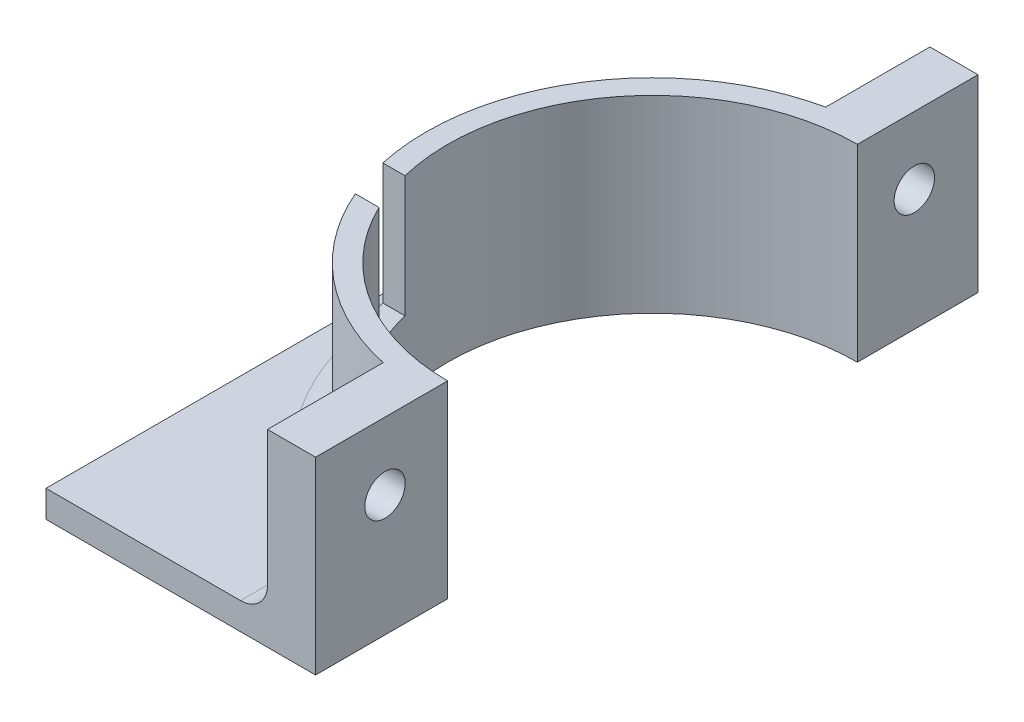
ISO-10303-21;
HEADER;
FILE_DESCRIPTION(('STEP AP214'),'2;1');
FILE_NAME('part.step','',(''),(''),'','','');
FILE_SCHEMA(('AUTOMOTIVE_DESIGN { 1 0 10303 214 1 1 1 1 }'));
ENDSEC;
DATA;
#1=APPLICATION_CONTEXT('core data for automotive mechanical design processes');
#2=APPLICATION_PROTOCOL_DEFINITION('international standard','automotive_design',2000,#1);
#3=PRODUCT_CONTEXT('',#1,'mechanical');
#4=PRODUCT('Part','Part','',(#3));
#5=PRODUCT_RELATED_PRODUCT_CATEGORY('part','',(#4));
#6=PRODUCT_DEFINITION_FORMATION('','',#4);
#7=PRODUCT_DEFINITION_CONTEXT('part definition',#1,'design');
#8=PRODUCT_DEFINITION('design','',#6,#7);
#9=PRODUCT_DEFINITION_SHAPE('','',#8);
#10=(LENGTH_UNIT() NAMED_UNIT(*) SI_UNIT(.MILLI.,.METRE.));
#11=(NAMED_UNIT(*) PLANE_ANGLE_UNIT() SI_UNIT($,.RADIAN.));
#12=(NAMED_UNIT(*) SI_UNIT($,.STERADIAN.) SOLID_ANGLE_UNIT());
#13=UNCERTAINTY_MEASURE_WITH_UNIT(LENGTH_MEASURE(1.E-05),#10,'distance_accuracy_value','');
#14=(GEOMETRIC_REPRESENTATION_CONTEXT(3) GLOBAL_UNCERTAINTY_ASSIGNED_CONTEXT((#13)) GLOBAL_UNIT_ASSIGNED_CONTEXT((#10,
#11,#12)) REPRESENTATION_CONTEXT('',''));
#15=CARTESIAN_POINT('',(0.,0.,0.));
#16=DIRECTION('',(0.,0.,1.));
#17=DIRECTION('',(1.,0.,0.));
#18=AXIS2_PLACEMENT_3D('',#15,#16,#17);
#19=CARTESIAN_POINT('',(25.4,17.78,-31.75));
#20=DIRECTION('',(0.,-1.,0.));
#21=DIRECTION('',(0.,0.,-1.));
#22=AXIS2_PLACEMENT_3D('',#19,#20,#21);
#23=CYLINDRICAL_SURFACE('',#22,21.336);
#24=DIRECTION('',(0.,-1.,0.));
#25=VECTOR('',#24,1.);
#26=CARTESIAN_POINT('',(5.77942477907439,17.78,-23.368));
#27=LINE('',#26,#25);
#28=CARTESIAN_POINT('',(5.77942477907439,6.35,-23.368));
#29=VERTEX_POINT('',#28);
#30=CARTESIAN_POINT('',(5.77942477907439,17.78,-23.368));
#31=VERTEX_POINT('',#30);
#32=EDGE_CURVE('E408',#29,#31,#27,.F.);
#33=ORIENTED_EDGE('',*,*,#32,.F.);
#34=CARTESIAN_POINT('',(25.4,6.35,-31.75));
#35=DIRECTION('',(0.,1.,0.));
#36=DIRECTION('',(0.,0.,1.));
#37=AXIS2_PLACEMENT_3D('',#34,#35,#36);
#38=CIRCLE('',#37,21.336);
#39=CARTESIAN_POINT('',(4.55961343928573,6.35,-27.178));
#40=VERTEX_POINT('',#39);
#41=EDGE_CURVE('E177',#40,#29,#38,.T.);
#42=ORIENTED_EDGE('',*,*,#41,.F.);
#43=DIRECTION('',(0.,-1.,0.));
#44=VECTOR('',#43,1.);
#45=CARTESIAN_POINT('',(4.55961343928573,17.78,-27.178));
#46=LINE('',#45,#44);
#47=CARTESIAN_POINT('',(4.55961343928573,17.78,-27.178));
#48=VERTEX_POINT('',#47);
#49=EDGE_CURVE('E162',#48,#40,#46,.T.);
#50=ORIENTED_EDGE('',*,*,#49,.F.);
#51=CARTESIAN_POINT('',(25.4,17.78,-31.75));
#52=DIRECTION('',(0.,1.,0.));
#53=DIRECTION('',(0.,0.,1.));
#54=AXIS2_PLACEMENT_3D('',#51,#52,#53);
#55=CIRCLE('',#54,21.336);
#56=CARTESIAN_POINT('',(20.8701679444107,17.78,-52.5995927429808));
#57=VERTEX_POINT('',#56);
#58=EDGE_CURVE('E175',#57,#48,#55,.T.);
#59=ORIENTED_EDGE('',*,*,#58,.F.);
#60=DIRECTION('',(0.,-1.,0.));
#61=VECTOR('',#60,1.);
#62=CARTESIAN_POINT('',(20.8701679444107,17.78,-52.5995927429808));
#63=LINE('',#62,#61);
#64=CARTESIAN_POINT('',(20.8701679444107,5.08,-52.5995927429808));
#65=VERTEX_POINT('',#64);
#66=EDGE_CURVE('E248',#57,#65,#63,.T.);
#67=ORIENTED_EDGE('',*,*,#66,.T.);
#68=CARTESIAN_POINT('',(25.4,5.08,-31.75));
#69=DIRECTION('',(0.,1.,0.));
#70=DIRECTION('',(0.,0.,1.));
#71=AXIS2_PLACEMENT_3D('',#68,#69,#70);
#72=CIRCLE('',#71,21.336);
#73=CARTESIAN_POINT('',(20.8701679444107,5.08,-10.9004072570192));
#74=VERTEX_POINT('',#73);
#75=EDGE_CURVE('E292',#65,#74,#72,.T.);
#76=ORIENTED_EDGE('',*,*,#75,.T.);
#77=DIRECTION('',(0.,-1.,0.));
#78=VECTOR('',#77,1.);
#79=CARTESIAN_POINT('',(20.8701679444107,17.78,-10.9004072570192));
#80=LINE('',#79,#78);
#81=CARTESIAN_POINT('',(20.8701679444107,17.78,-10.9004072570192));
#82=VERTEX_POINT('',#81);
#83=EDGE_CURVE('E245',#82,#74,#80,.T.);
#84=ORIENTED_EDGE('',*,*,#83,.F.);
#85=EDGE_CURVE('E188',#31,#82,#55,.T.);
#86=ORIENTED_EDGE('',*,*,#85,.F.);
#87=EDGE_LOOP('',(#33,#42,#50,#59,#67,#76,#84,#86));
#88=FACE_BOUND('',#87,.T.);
#89=ADVANCED_FACE('F45',(#88),#23,.T.);
#90=CARTESIAN_POINT('',(25.4,17.78,-31.75));
#91=DIRECTION('',(0.,-1.,0.));
#92=DIRECTION('',(0.,0.,-1.));
#93=AXIS2_PLACEMENT_3D('',#90,#91,#92);
#94=CYLINDRICAL_SURFACE('',#93,19.304);
#95=CARTESIAN_POINT('',(25.4,6.35,-31.75));
#96=DIRECTION('',(0.,1.,0.));
#97=DIRECTION('',(0.,0.,1.));
#98=AXIS2_PLACEMENT_3D('',#95,#96,#97);
#99=CIRCLE('',#98,19.304);
#100=CARTESIAN_POINT('',(6.64523441895368,6.35,-27.178));
#101=VERTEX_POINT('',#100);
#102=CARTESIAN_POINT('',(8.01073630080906,6.35,-23.368));
#103=VERTEX_POINT('',#102);
#104=EDGE_CURVE('E11',#101,#103,#99,.T.);
#105=ORIENTED_EDGE('',*,*,#104,.T.);
#106=DIRECTION('',(0.,-1.,0.));
#107=VECTOR('',#106,1.);
#108=CARTESIAN_POINT('',(8.01073630080906,17.78,-23.368));
#109=LINE('',#108,#107);
#110=CARTESIAN_POINT('',(8.01073630080906,17.78,-23.368));
#111=VERTEX_POINT('',#110);
#112=EDGE_CURVE('E179',#103,#111,#109,.F.);
#113=ORIENTED_EDGE('',*,*,#112,.T.);
#114=CARTESIAN_POINT('',(25.4,17.78,-31.75));
#115=DIRECTION('',(0.,1.,0.));
#116=DIRECTION('',(0.,0.,1.));
#117=AXIS2_PLACEMENT_3D('',#114,#115,#116);
#118=CIRCLE('',#117,19.304);
#119=CARTESIAN_POINT('',(25.4,17.78,-12.446));
#120=VERTEX_POINT('',#119);
#121=EDGE_CURVE('E205',#111,#120,#118,.T.);
#122=ORIENTED_EDGE('',*,*,#121,.T.);
#123=DIRECTION('',(0.,-1.,0.));
#124=VECTOR('',#123,1.);
#125=CARTESIAN_POINT('',(25.4,17.78,-12.446));
#126=LINE('',#125,#124);
#127=CARTESIAN_POINT('',(25.4,0.,-12.446));
#128=VERTEX_POINT('',#127);
#129=EDGE_CURVE('E235',#120,#128,#126,.T.);
#130=ORIENTED_EDGE('',*,*,#129,.T.);
#131=CARTESIAN_POINT('',(25.4,0.,-31.75));
#132=DIRECTION('',(0.,1.,0.));
#133=DIRECTION('',(0.,0.,1.));
#134=AXIS2_PLACEMENT_3D('',#131,#132,#133);
#135=CIRCLE('',#134,19.304);
#136=CARTESIAN_POINT('',(25.4,0.,-51.054));
#137=VERTEX_POINT('',#136);
#138=EDGE_CURVE('E219',#137,#128,#135,.T.);
#139=ORIENTED_EDGE('',*,*,#138,.F.);
#140=DIRECTION('',(0.,-1.,0.));
#141=VECTOR('',#140,1.);
#142=CARTESIAN_POINT('',(25.4,17.78,-51.054));
#143=LINE('',#142,#141);
#144=CARTESIAN_POINT('',(25.4,17.78,-51.054));
#145=VERTEX_POINT('',#144);
#146=EDGE_CURVE('E232',#145,#137,#143,.T.);
#147=ORIENTED_EDGE('',*,*,#146,.F.);
#148=CARTESIAN_POINT('',(6.64523441895368,17.78,-27.178));
#149=VERTEX_POINT('',#148);
#150=EDGE_CURVE('E207',#145,#149,#118,.T.);
#151=ORIENTED_EDGE('',*,*,#150,.T.);
#152=DIRECTION('',(0.,-1.,0.));
#153=VECTOR('',#152,1.);
#154=CARTESIAN_POINT('',(6.64523441895368,17.78,-27.178));
#155=LINE('',#154,#153);
#156=EDGE_CURVE('E62',#149,#101,#155,.T.);
#157=ORIENTED_EDGE('',*,*,#156,.T.);
#158=EDGE_LOOP('',(#105,#113,#122,#130,#139,#147,#151,#157));
#159=FACE_BOUND('',#158,.T.);
#160=ADVANCED_FACE('F333',(#159),#94,.F.);
#161=CARTESIAN_POINT('',(0.,17.78,0.));
#162=DIRECTION('',(0.,1.,0.));
#163=DIRECTION('',(0.,0.,1.));
#164=AXIS2_PLACEMENT_3D('',#161,#162,#163);
#165=PLANE('',#164);
#166=ORIENTED_EDGE('',*,*,#121,.F.);
#167=DIRECTION('',(-1.,0.,0.));
#168=VECTOR('',#167,1.);
#169=CARTESIAN_POINT('',(0.,17.78,-23.368));
#170=LINE('',#169,#168);
#171=EDGE_CURVE('E55',#111,#31,#170,.T.);
#172=ORIENTED_EDGE('',*,*,#171,.T.);
#173=ORIENTED_EDGE('',*,*,#85,.T.);
#174=DIRECTION('',(0.,0.,-1.));
#175=VECTOR('',#174,1.);
#176=CARTESIAN_POINT('',(20.8701679444107,17.78,0.));
#177=LINE('',#176,#175);
#178=CARTESIAN_POINT('',(20.8701679444107,17.78,0.));
#179=VERTEX_POINT('',#178);
#180=EDGE_CURVE('E187',#179,#82,#177,.T.);
#181=ORIENTED_EDGE('',*,*,#180,.F.);
#182=DIRECTION('',(-1.,0.,0.));
#183=VECTOR('',#182,1.);
#184=CARTESIAN_POINT('',(0.,17.78,0.));
#185=LINE('',#184,#183);
#186=CARTESIAN_POINT('',(25.4,17.78,0.));
#187=VERTEX_POINT('',#186);
#188=EDGE_CURVE('E193',#187,#179,#185,.T.);
#189=ORIENTED_EDGE('',*,*,#188,.F.);
#190=DIRECTION('',(0.,0.,1.));
#191=VECTOR('',#190,1.);
#192=CARTESIAN_POINT('',(25.4,17.78,0.));
#193=LINE('',#192,#191);
#194=EDGE_CURVE('E201',#120,#187,#193,.T.);
#195=ORIENTED_EDGE('',*,*,#194,.F.);
#196=EDGE_LOOP('',(#166,#172,#173,#181,#189,#195));
#197=FACE_BOUND('',#196,.T.);
#198=ADVANCED_FACE('F338',(#197),#165,.T.);
#199=ORIENTED_EDGE('',*,*,#58,.T.);
#200=DIRECTION('',(1.,0.,0.));
#201=VECTOR('',#200,1.);
#202=CARTESIAN_POINT('',(0.,17.78,-27.178));
#203=LINE('',#202,#201);
#204=EDGE_CURVE('E159',#48,#149,#203,.T.);
#205=ORIENTED_EDGE('',*,*,#204,.T.);
#206=ORIENTED_EDGE('',*,*,#150,.F.);
#207=CARTESIAN_POINT('',(25.4,17.78,-62.416249180244));
#208=VERTEX_POINT('',#207);
#209=EDGE_CURVE('E206',#208,#145,#193,.T.);
#210=ORIENTED_EDGE('',*,*,#209,.F.);
#211=DIRECTION('',(1.,0.,0.));
#212=VECTOR('',#211,1.);
#213=CARTESIAN_POINT('',(0.,17.78,-62.416249180244));
#214=LINE('',#213,#212);
#215=CARTESIAN_POINT('',(20.8701679444107,17.78,-62.416249180244));
#216=VERTEX_POINT('',#215);
#217=EDGE_CURVE('E210',#216,#208,#214,.T.);
#218=ORIENTED_EDGE('',*,*,#217,.F.);
#219=DIRECTION('',(0.,0.,1.));
#220=VECTOR('',#219,1.);
#221=CARTESIAN_POINT('',(20.8701679444107,17.78,0.));
#222=LINE('',#221,#220);
#223=EDGE_CURVE('E184',#216,#57,#222,.T.);
#224=ORIENTED_EDGE('',*,*,#223,.T.);
#225=EDGE_LOOP('',(#199,#205,#206,#210,#218,#224));
#226=FACE_BOUND('',#225,.T.);
#227=ADVANCED_FACE('F181',(#226),#165,.T.);
#228=CARTESIAN_POINT('',(0.,2.54,-62.416249180244));
#229=DIRECTION('',(0.,0.,-1.));
#230=DIRECTION('',(-1.,0.,0.));
#231=AXIS2_PLACEMENT_3D('',#228,#229,#230);
#232=PLANE('',#231);
#233=DIRECTION('',(1.,0.,0.));
#234=VECTOR('',#233,1.);
#235=CARTESIAN_POINT('',(0.,0.,-62.416249180244));
#236=LINE('',#235,#234);
#237=CARTESIAN_POINT('',(0.,0.,-62.416249180244));
#238=VERTEX_POINT('',#237);
#239=CARTESIAN_POINT('',(25.4,0.,-62.416249180244));
#240=VERTEX_POINT('',#239);
#241=EDGE_CURVE('E251',#238,#240,#236,.T.);
#242=ORIENTED_EDGE('',*,*,#241,.F.);
#243=DIRECTION('',(0.,-1.,0.));
#244=VECTOR('',#243,1.);
#245=CARTESIAN_POINT('',(0.,2.54,-62.416249180244));
#246=LINE('',#245,#244);
#247=CARTESIAN_POINT('',(0.,2.54,-62.416249180244));
#248=VERTEX_POINT('',#247);
#249=EDGE_CURVE('E276',#248,#238,#246,.T.);
#250=ORIENTED_EDGE('',*,*,#249,.F.);
#251=DIRECTION('',(1.,0.,0.));
#252=VECTOR('',#251,1.);
#253=CARTESIAN_POINT('',(0.,2.54,-62.416249180244));
#254=LINE('',#253,#252);
#255=CARTESIAN_POINT('',(18.3301679444107,2.54,-62.416249180244));
#256=VERTEX_POINT('',#255);
#257=EDGE_CURVE('E252',#248,#256,#254,.T.);
#258=ORIENTED_EDGE('',*,*,#257,.T.);
#259=CARTESIAN_POINT('',(18.3301679444107,5.08,-62.416249180244));
#260=DIRECTION('',(0.,0.,-1.));
#261=DIRECTION('',(-1.,0.,0.));
#262=AXIS2_PLACEMENT_3D('',#259,#260,#261);
#263=CIRCLE('',#262,2.54);
#264=CARTESIAN_POINT('',(20.8701679444107,5.08,-62.416249180244));
#265=VERTEX_POINT('',#264);
#266=EDGE_CURVE('E297',#256,#265,#263,.F.);
#267=ORIENTED_EDGE('',*,*,#266,.T.);
#268=DIRECTION('',(0.,-1.,0.));
#269=VECTOR('',#268,1.);
#270=CARTESIAN_POINT('',(20.8701679444107,17.78,-62.416249180244));
#271=LINE('',#270,#269);
#272=EDGE_CURVE('E214',#216,#265,#271,.T.);
#273=ORIENTED_EDGE('',*,*,#272,.F.);
#274=ORIENTED_EDGE('',*,*,#217,.T.);
#275=DIRECTION('',(0.,-1.,0.));
#276=VECTOR('',#275,1.);
#277=CARTESIAN_POINT('',(25.4,17.78,-62.416249180244));
#278=LINE('',#277,#276);
#279=EDGE_CURVE('E228',#208,#240,#278,.T.);
#280=ORIENTED_EDGE('',*,*,#279,.T.);
#281=EDGE_LOOP('',(#242,#250,#258,#267,#273,#274,#280));
#282=FACE_BOUND('',#281,.T.);
#283=ADVANCED_FACE('F362',(#282),#232,.T.);
#284=CARTESIAN_POINT('',(0.,2.54,0.));
#285=DIRECTION('',(-1.,0.,0.));
#286=DIRECTION('',(0.,0.,1.));
#287=AXIS2_PLACEMENT_3D('',#284,#285,#286);
#288=PLANE('',#287);
#289=DIRECTION('',(0.,0.,-1.));
#290=VECTOR('',#289,1.);
#291=CARTESIAN_POINT('',(0.,0.,0.));
#292=LINE('',#291,#290);
#293=CARTESIAN_POINT('',(0.,0.,0.));
#294=VERTEX_POINT('',#293);
#295=EDGE_CURVE('E267',#294,#238,#292,.T.);
#296=ORIENTED_EDGE('',*,*,#295,.F.);
#297=DIRECTION('',(0.,-1.,0.));
#298=VECTOR('',#297,1.);
#299=CARTESIAN_POINT('',(0.,2.54,0.));
#300=LINE('',#299,#298);
#301=CARTESIAN_POINT('',(0.,2.54,0.));
#302=VERTEX_POINT('',#301);
#303=EDGE_CURVE('E264',#302,#294,#300,.T.);
#304=ORIENTED_EDGE('',*,*,#303,.F.);
#305=DIRECTION('',(0.,0.,-1.));
#306=VECTOR('',#305,1.);
#307=CARTESIAN_POINT('',(0.,2.54,0.));
#308=LINE('',#307,#306);
#309=EDGE_CURVE('E256',#302,#248,#308,.T.);
#310=ORIENTED_EDGE('',*,*,#309,.T.);
#311=ORIENTED_EDGE('',*,*,#249,.T.);
#312=EDGE_LOOP('',(#296,#304,#310,#311));
#313=FACE_BOUND('',#312,.T.);
#314=ADVANCED_FACE('F359',(#313),#288,.T.);
#315=CARTESIAN_POINT('',(0.,2.54,0.));
#316=DIRECTION('',(0.,0.,1.));
#317=DIRECTION('',(1.,0.,0.));
#318=AXIS2_PLACEMENT_3D('',#315,#316,#317);
#319=PLANE('',#318);
#320=DIRECTION('',(-1.,0.,0.));
#321=VECTOR('',#320,1.);
#322=CARTESIAN_POINT('',(0.,0.,0.));
#323=LINE('',#322,#321);
#324=CARTESIAN_POINT('',(25.4,0.,0.));
#325=VERTEX_POINT('',#324);
#326=EDGE_CURVE('E257',#325,#294,#323,.T.);
#327=ORIENTED_EDGE('',*,*,#326,.F.);
#328=DIRECTION('',(0.,-1.,0.));
#329=VECTOR('',#328,1.);
#330=CARTESIAN_POINT('',(25.4,17.78,0.));
#331=LINE('',#330,#329);
#332=EDGE_CURVE('E238',#187,#325,#331,.T.);
#333=ORIENTED_EDGE('',*,*,#332,.F.);
#334=ORIENTED_EDGE('',*,*,#188,.T.);
#335=DIRECTION('',(0.,-1.,0.));
#336=VECTOR('',#335,1.);
#337=CARTESIAN_POINT('',(20.8701679444107,17.78,0.));
#338=LINE('',#337,#336);
#339=CARTESIAN_POINT('',(20.8701679444107,5.08,0.));
#340=VERTEX_POINT('',#339);
#341=EDGE_CURVE('E242',#179,#340,#338,.T.);
#342=ORIENTED_EDGE('',*,*,#341,.T.);
#343=CARTESIAN_POINT('',(18.3301679444107,5.08,0.));
#344=DIRECTION('',(0.,0.,1.));
#345=DIRECTION('',(1.,0.,0.));
#346=AXIS2_PLACEMENT_3D('',#343,#344,#345);
#347=CIRCLE('',#346,2.54);
#348=CARTESIAN_POINT('',(18.3301679444107,2.54,0.));
#349=VERTEX_POINT('',#348);
#350=EDGE_CURVE('E169',#340,#349,#347,.F.);
#351=ORIENTED_EDGE('',*,*,#350,.T.);
#352=DIRECTION('',(-1.,0.,0.));
#353=VECTOR('',#352,1.);
#354=CARTESIAN_POINT('',(0.,2.54,0.));
#355=LINE('',#354,#353);
#356=EDGE_CURVE('E261',#349,#302,#355,.T.);
#357=ORIENTED_EDGE('',*,*,#356,.T.);
#358=ORIENTED_EDGE('',*,*,#303,.T.);
#359=EDGE_LOOP('',(#327,#333,#334,#342,#351,#357,#358));
#360=FACE_BOUND('',#359,.T.);
#361=ADVANCED_FACE('F352',(#360),#319,.T.);
#362=CARTESIAN_POINT('',(0.,2.54,0.));
#363=DIRECTION('',(0.,1.,0.));
#364=DIRECTION('',(0.,0.,1.));
#365=AXIS2_PLACEMENT_3D('',#362,#363,#364);
#366=PLANE('',#365);
#367=CARTESIAN_POINT('',(25.4,2.54,-31.75));
#368=DIRECTION('',(0.,1.,0.));
#369=DIRECTION('',(0.,0.,1.));
#370=AXIS2_PLACEMENT_3D('',#367,#368,#369);
#371=CIRCLE('',#370,23.876);
#372=CARTESIAN_POINT('',(18.3301679444107,2.54,-8.94471879792397));
#373=VERTEX_POINT('',#372);
#374=CARTESIAN_POINT('',(18.3301679444107,2.54,-54.555281202076));
#375=VERTEX_POINT('',#374);
#376=EDGE_CURVE('E286',#373,#375,#371,.F.);
#377=ORIENTED_EDGE('',*,*,#376,.T.);
#378=DIRECTION('',(0.,0.,1.));
#379=VECTOR('',#378,1.);
#380=CARTESIAN_POINT('',(18.3301679444107,2.54,0.));
#381=LINE('',#380,#379);
#382=EDGE_CURVE('E289',#375,#256,#381,.F.);
#383=ORIENTED_EDGE('',*,*,#382,.T.);
#384=ORIENTED_EDGE('',*,*,#257,.F.);
#385=ORIENTED_EDGE('',*,*,#309,.F.);
#386=ORIENTED_EDGE('',*,*,#356,.F.);
#387=DIRECTION('',(0.,0.,-1.));
#388=VECTOR('',#387,1.);
#389=CARTESIAN_POINT('',(18.3301679444107,2.54,-10.9004072570192));
#390=LINE('',#389,#388);
#391=EDGE_CURVE('E283',#349,#373,#390,.T.);
#392=ORIENTED_EDGE('',*,*,#391,.T.);
#393=EDGE_LOOP('',(#377,#383,#384,#385,#386,#392));
#394=FACE_BOUND('',#393,.T.);
#395=ADVANCED_FACE('F349',(#394),#366,.T.);
#396=CARTESIAN_POINT('',(0.,0.,0.));
#397=DIRECTION('',(0.,1.,0.));
#398=DIRECTION('',(0.,0.,1.));
#399=AXIS2_PLACEMENT_3D('',#396,#397,#398);
#400=PLANE('',#399);
#401=ORIENTED_EDGE('',*,*,#241,.T.);
#402=DIRECTION('',(0.,0.,1.));
#403=VECTOR('',#402,1.);
#404=CARTESIAN_POINT('',(25.4,0.,0.));
#405=LINE('',#404,#403);
#406=EDGE_CURVE('E221',#240,#137,#405,.T.);
#407=ORIENTED_EDGE('',*,*,#406,.T.);
#408=ORIENTED_EDGE('',*,*,#138,.T.);
#409=EDGE_CURVE('E215',#128,#325,#405,.T.);
#410=ORIENTED_EDGE('',*,*,#409,.T.);
#411=ORIENTED_EDGE('',*,*,#326,.T.);
#412=ORIENTED_EDGE('',*,*,#295,.T.);
#413=EDGE_LOOP('',(#401,#407,#408,#410,#411,#412));
#414=FACE_BOUND('',#413,.T.);
#415=ADVANCED_FACE('F347',(#414),#400,.F.);
#416=CARTESIAN_POINT('',(20.8701679444107,17.78,0.));
#417=DIRECTION('',(1.,0.,0.));
#418=DIRECTION('',(0.,0.,-1.));
#419=AXIS2_PLACEMENT_3D('',#416,#417,#418);
#420=PLANE('',#419);
#421=CARTESIAN_POINT('',(20.8701679444107,11.43,-56.417624590122));
#422=DIRECTION('',(1.,0.,0.));
#423=DIRECTION('',(0.,0.,-1.));
#424=AXIS2_PLACEMENT_3D('',#421,#422,#423);
#425=CIRCLE('',#424,1.905);
#426=CARTESIAN_POINT('',(20.8701679444107,11.43,-58.322624590122));
#427=VERTEX_POINT('',#426);
#428=EDGE_CURVE('E395',#427,#427,#425,.F.);
#429=ORIENTED_EDGE('',*,*,#428,.F.);
#430=EDGE_LOOP('',(#429));
#431=FACE_BOUND('',#430,.T.);
#432=ORIENTED_EDGE('',*,*,#272,.T.);
#433=DIRECTION('',(0.,0.,1.));
#434=VECTOR('',#433,1.);
#435=CARTESIAN_POINT('',(20.8701679444107,5.08,0.));
#436=LINE('',#435,#434);
#437=EDGE_CURVE('E279',#265,#65,#436,.T.);
#438=ORIENTED_EDGE('',*,*,#437,.T.);
#439=ORIENTED_EDGE('',*,*,#66,.F.);
#440=ORIENTED_EDGE('',*,*,#223,.F.);
#441=EDGE_LOOP('',(#432,#438,#439,#440));
#442=FACE_BOUND('',#441,.T.);
#443=ADVANCED_FACE('F344',(#431,#442),#420,.F.);
#444=CARTESIAN_POINT('',(20.8701679444107,17.78,0.));
#445=DIRECTION('',(-1.,0.,0.));
#446=DIRECTION('',(0.,0.,1.));
#447=AXIS2_PLACEMENT_3D('',#444,#445,#446);
#448=PLANE('',#447);
#449=CARTESIAN_POINT('',(20.8701679444107,11.43,-6.5405));
#450=DIRECTION('',(-1.,0.,0.));
#451=DIRECTION('',(0.,0.,1.));
#452=AXIS2_PLACEMENT_3D('',#449,#450,#451);
#453=CIRCLE('',#452,1.905);
#454=CARTESIAN_POINT('',(20.8701679444107,11.43,-4.6355));
#455=VERTEX_POINT('',#454);
#456=EDGE_CURVE('E310',#455,#455,#453,.F.);
#457=ORIENTED_EDGE('',*,*,#456,.T.);
#458=EDGE_LOOP('',(#457));
#459=FACE_BOUND('',#458,.T.);
#460=ORIENTED_EDGE('',*,*,#83,.T.);
#461=DIRECTION('',(0.,0.,-1.));
#462=VECTOR('',#461,1.);
#463=CARTESIAN_POINT('',(20.8701679444107,5.08,0.));
#464=LINE('',#463,#462);
#465=EDGE_CURVE('E70',#74,#340,#464,.F.);
#466=ORIENTED_EDGE('',*,*,#465,.T.);
#467=ORIENTED_EDGE('',*,*,#341,.F.);
#468=ORIENTED_EDGE('',*,*,#180,.T.);
#469=EDGE_LOOP('',(#460,#466,#467,#468));
#470=FACE_BOUND('',#469,.T.);
#471=ADVANCED_FACE('F343',(#459,#470),#448,.T.);
#472=CARTESIAN_POINT('',(25.4,17.78,0.));
#473=DIRECTION('',(1.,0.,0.));
#474=DIRECTION('',(0.,0.,-1.));
#475=AXIS2_PLACEMENT_3D('',#472,#473,#474);
#476=PLANE('',#475);
#477=CARTESIAN_POINT('',(25.4,11.43,-6.5405));
#478=DIRECTION('',(1.,0.,0.));
#479=DIRECTION('',(0.,0.,-1.));
#480=AXIS2_PLACEMENT_3D('',#477,#478,#479);
#481=CIRCLE('',#480,1.905);
#482=CARTESIAN_POINT('',(25.4,11.43,-8.4455));
#483=VERTEX_POINT('',#482);
#484=EDGE_CURVE('E402',#483,#483,#481,.T.);
#485=ORIENTED_EDGE('',*,*,#484,.F.);
#486=EDGE_LOOP('',(#485));
#487=FACE_BOUND('',#486,.T.);
#488=ORIENTED_EDGE('',*,*,#409,.F.);
#489=ORIENTED_EDGE('',*,*,#129,.F.);
#490=ORIENTED_EDGE('',*,*,#194,.T.);
#491=ORIENTED_EDGE('',*,*,#332,.T.);
#492=EDGE_LOOP('',(#488,#489,#490,#491));
#493=FACE_BOUND('',#492,.T.);
#494=ADVANCED_FACE('F439',(#487,#493),#476,.T.);
#495=CARTESIAN_POINT('',(25.4,11.43,-56.417624590122));
#496=DIRECTION('',(1.,0.,0.));
#497=DIRECTION('',(0.,0.,-1.));
#498=AXIS2_PLACEMENT_3D('',#495,#496,#497);
#499=CIRCLE('',#498,1.905);
#500=CARTESIAN_POINT('',(25.4,11.43,-58.322624590122));
#501=VERTEX_POINT('',#500);
#502=EDGE_CURVE('E398',#501,#501,#499,.T.);
#503=ORIENTED_EDGE('',*,*,#502,.F.);
#504=EDGE_LOOP('',(#503));
#505=FACE_BOUND('',#504,.T.);
#506=ORIENTED_EDGE('',*,*,#406,.F.);
#507=ORIENTED_EDGE('',*,*,#279,.F.);
#508=ORIENTED_EDGE('',*,*,#209,.T.);
#509=ORIENTED_EDGE('',*,*,#146,.T.);
#510=EDGE_LOOP('',(#506,#507,#508,#509));
#511=FACE_BOUND('',#510,.T.);
#512=ADVANCED_FACE('F329',(#505,#511),#476,.T.);
#513=CARTESIAN_POINT('',(18.3301679444107,5.08,0.));
#514=DIRECTION('',(0.,0.,1.));
#515=DIRECTION('',(1.,0.,0.));
#516=AXIS2_PLACEMENT_3D('',#513,#514,#515);
#517=CYLINDRICAL_SURFACE('',#516,2.54);
#518=ORIENTED_EDGE('',*,*,#350,.F.);
#519=ORIENTED_EDGE('',*,*,#465,.F.);
#520=CARTESIAN_POINT('',(20.8701679444107,5.08,-10.9004072570192));
#521=CARTESIAN_POINT('',(20.8701810232402,5.01947008584814,-10.9004186931537));
#522=CARTESIAN_POINT('',(20.8680046653078,4.95894926315979,-10.8986635284363));
#523=CARTESIAN_POINT('',(20.8593736209366,4.83844714540674,-10.8917075979104));
#524=CARTESIAN_POINT('',(20.8529214319116,4.77846555610398,-10.8865088434237));
#525=CARTESIAN_POINT('',(20.8358952576444,4.65988290248846,-10.8727984036691));
#526=CARTESIAN_POINT('',(20.8253486737506,4.60127535122768,-10.8643087430335));
#527=CARTESIAN_POINT('',(20.8003196634485,4.48547086791238,-10.8441782583122));
#528=CARTESIAN_POINT('',(20.7858368587935,4.42827407199926,-10.8325371313902));
#529=CARTESIAN_POINT('',(20.7368709184162,4.25961588969205,-10.7932199171705));
#530=CARTESIAN_POINT('',(20.6968177486151,4.15073314988319,-10.7611075482907));
#531=CARTESIAN_POINT('',(20.6039470287444,3.94218681087413,-10.6868759262093));
#532=CARTESIAN_POINT('',(20.5511097110352,3.84253782272534,-10.644741177506));
#533=CARTESIAN_POINT('',(20.4301944370283,3.6461869641249,-10.5486666357273));
#534=CARTESIAN_POINT('',(20.3612336505548,3.55036347043179,-10.4940508050211));
#535=CARTESIAN_POINT('',(20.2134753427024,3.37172312569229,-10.3775436923927));
#536=CARTESIAN_POINT('',(20.1346759022083,3.28890881933766,-10.3156509911912));
#537=CARTESIAN_POINT('',(19.9516499766958,3.12014913111811,-10.1725769727366));
#538=CARTESIAN_POINT('',(19.8455844528275,3.0373014036582,-10.0900968153693));
#539=CARTESIAN_POINT('',(19.6249395182042,2.89076724042379,-9.91956596562845));
#540=CARTESIAN_POINT('',(19.5103497732193,2.82710455144658,-9.83150853157242));
#541=CARTESIAN_POINT('',(19.250397348627,2.70737777244191,-9.63300242298326));
#542=CARTESIAN_POINT('',(19.1036272758289,2.65571990965629,-9.52173619490241));
#543=CARTESIAN_POINT('',(18.8050239951573,2.5800432146939,-9.29710657954014));
#544=CARTESIAN_POINT('',(18.6531990612627,2.55598130023189,-9.18374674271077));
#545=CARTESIAN_POINT('',(18.4465854817054,2.54209380201909,-9.03063832024779));
#546=CARTESIAN_POINT('',(18.3925545400437,2.54019031779196,-8.99070560380764));
#547=CARTESIAN_POINT('',(18.3357029012457,2.54000452481026,-8.94879801383146));
#548=CARTESIAN_POINT('',(18.3329354891072,2.54000000176988,-8.94675831820905));
#549=CARTESIAN_POINT('',(18.3301679444107,2.54,-8.94471879792397));
#550=B_SPLINE_CURVE_WITH_KNOTS('',3,(#520,#521,#522,#523,#524,#525,#526,#527,#528,#529,#530,
#531,#532,#533,#534,#535,#536,#537,#538,#539,#540,#541,#542,#543,#544,#545,#546,#547,#548,#549),
.UNSPECIFIED.,.F.,.F.,(4,2,2,2,2,2,2,2,2,2,2,2,2,2,4),(0.,0.181510291158383,0.362914659697582,
0.543125362795528,0.723353389166492,1.08274370549116,1.44269332522132,1.83153127452595,
2.22044518890873,2.69228688912453,3.16471024765354,3.73638373724546,4.30716352060647,
4.50873549755395,4.51904909793668),.UNSPECIFIED.);
#551=EDGE_CURVE('E220',#373,#74,#550,.F.);
#552=ORIENTED_EDGE('',*,*,#551,.F.);
#553=ORIENTED_EDGE('',*,*,#391,.F.);
#554=EDGE_LOOP('',(#518,#519,#552,#553));
#555=FACE_BOUND('',#554,.T.);
#556=ADVANCED_FACE('F47',(#555),#517,.F.);
#557=CARTESIAN_POINT('',(25.4,5.08,-31.75));
#558=DIRECTION('',(0.,1.,0.));
#559=DIRECTION('',(0.,0.,1.));
#560=AXIS2_PLACEMENT_3D('',#557,#558,#559);
#561=TOROIDAL_SURFACE('',#560,23.876,2.54);
#562=ORIENTED_EDGE('',*,*,#551,.T.);
#563=ORIENTED_EDGE('',*,*,#75,.F.);
#564=CARTESIAN_POINT('',(20.8701679444107,5.08,-52.5995927429808));
#565=CARTESIAN_POINT('',(20.8701810232403,5.01947008584814,-52.5995813068463));
#566=CARTESIAN_POINT('',(20.8680046653078,4.95894926315979,-52.6013364715637));
#567=CARTESIAN_POINT('',(20.8593736209366,4.83844714540674,-52.6082924020896));
#568=CARTESIAN_POINT('',(20.8529214319116,4.77846555610398,-52.6134911565763));
#569=CARTESIAN_POINT('',(20.8358952576444,4.65988290248846,-52.6272015963309));
#570=CARTESIAN_POINT('',(20.8253486737506,4.60127535122768,-52.6356912569665));
#571=CARTESIAN_POINT('',(20.8003196634485,4.48547086791238,-52.6558217416879));
#572=CARTESIAN_POINT('',(20.7858368587935,4.42827407199926,-52.6674628686098));
#573=CARTESIAN_POINT('',(20.7368709184162,4.25961588969206,-52.7067800828295));
#574=CARTESIAN_POINT('',(20.6968177486151,4.1507331498832,-52.7388924517093));
#575=CARTESIAN_POINT('',(20.6039470287444,3.94218681087414,-52.8131240737907));
#576=CARTESIAN_POINT('',(20.5511097110352,3.84253782272534,-52.855258822494));
#577=CARTESIAN_POINT('',(20.4301944370283,3.6461869641249,-52.9513333642727));
#578=CARTESIAN_POINT('',(20.3612336505548,3.55036347043179,-53.0059491949789));
#579=CARTESIAN_POINT('',(20.2134753427024,3.37172312569229,-53.1224563076073));
#580=CARTESIAN_POINT('',(20.1346759022083,3.28890881933766,-53.1843490088089));
#581=CARTESIAN_POINT('',(19.9516499766958,3.12014913111811,-53.3274230272634));
#582=CARTESIAN_POINT('',(19.8455844528275,3.03730140365821,-53.4099031846307));
#583=CARTESIAN_POINT('',(19.6249395182042,2.89076724042379,-53.5804340343716));
#584=CARTESIAN_POINT('',(19.5103497732194,2.82710455144658,-53.6684914684276));
#585=CARTESIAN_POINT('',(19.250397348627,2.70737777244191,-53.8669975770167));
#586=CARTESIAN_POINT('',(19.1036272758288,2.65571990965629,-53.9782638050974));
#587=CARTESIAN_POINT('',(18.8050239951574,2.5800432146939,-54.2028934204601));
#588=CARTESIAN_POINT('',(18.6531990612632,2.55598130023189,-54.3162532572899));
#589=CARTESIAN_POINT('',(18.4465854817052,2.54209380201909,-54.469361679752));
#590=CARTESIAN_POINT('',(18.3925545400433,2.54019031779196,-54.5092943961917));
#591=CARTESIAN_POINT('',(18.3357029012456,2.54000452481026,-54.5512019861685));
#592=CARTESIAN_POINT('',(18.3329354891072,2.54000000176988,-54.5532416817909));
#593=CARTESIAN_POINT('',(18.3301679444107,2.54,-54.555281202076));
#594=B_SPLINE_CURVE_WITH_KNOTS('',3,(#564,#565,#566,#567,#568,#569,#570,#571,#572,#573,#574,
#575,#576,#577,#578,#579,#580,#581,#582,#583,#584,#585,#586,#587,#588,#589,#590,#591,#592,#593),
.UNSPECIFIED.,.F.,.F.,(4,2,2,2,2,2,2,2,2,2,2,2,2,2,4),(0.,0.181510291158383,0.362914659697581,
0.543125362795526,0.723353389166492,1.08274370549115,1.44269332522131,1.83153127452595,
2.22044518890873,2.69228688912453,3.16471024765354,3.73638373724547,4.30716352060646,
4.50873549755395,4.51904909793668),.UNSPECIFIED.);
#595=EDGE_CURVE('E302',#375,#65,#594,.F.);
#596=ORIENTED_EDGE('',*,*,#595,.F.);
#597=ORIENTED_EDGE('',*,*,#376,.F.);
#598=EDGE_LOOP('',(#562,#563,#596,#597));
#599=FACE_BOUND('',#598,.T.);
#600=ADVANCED_FACE('F318',(#599),#561,.F.);
#601=CARTESIAN_POINT('',(18.3301679444107,5.08,0.));
#602=DIRECTION('',(0.,0.,1.));
#603=DIRECTION('',(1.,0.,0.));
#604=AXIS2_PLACEMENT_3D('',#601,#602,#603);
#605=CYLINDRICAL_SURFACE('',#604,2.54);
#606=ORIENTED_EDGE('',*,*,#266,.F.);
#607=ORIENTED_EDGE('',*,*,#382,.F.);
#608=ORIENTED_EDGE('',*,*,#595,.T.);
#609=ORIENTED_EDGE('',*,*,#437,.F.);
#610=EDGE_LOOP('',(#606,#607,#608,#609));
#611=FACE_BOUND('',#610,.T.);
#612=ADVANCED_FACE('F315',(#611),#605,.F.);
#613=CARTESIAN_POINT('',(25.4,11.43,-56.417624590122));
#614=DIRECTION('',(-1.,0.,0.));
#615=DIRECTION('',(0.,0.,1.));
#616=AXIS2_PLACEMENT_3D('',#613,#614,#615);
#617=CYLINDRICAL_SURFACE('',#616,1.905);
#618=ORIENTED_EDGE('',*,*,#502,.T.);
#619=EDGE_LOOP('',(#618));
#620=FACE_BOUND('',#619,.T.);
#621=ORIENTED_EDGE('',*,*,#428,.T.);
#622=EDGE_LOOP('',(#621));
#623=FACE_BOUND('',#622,.T.);
#624=ADVANCED_FACE('F327',(#620,#623),#617,.F.);
#625=CARTESIAN_POINT('',(25.4,11.43,-6.5405));
#626=DIRECTION('',(-1.,0.,0.));
#627=DIRECTION('',(0.,0.,1.));
#628=AXIS2_PLACEMENT_3D('',#625,#626,#627);
#629=CYLINDRICAL_SURFACE('',#628,1.905);
#630=ORIENTED_EDGE('',*,*,#456,.F.);
#631=EDGE_LOOP('',(#630));
#632=FACE_BOUND('',#631,.T.);
#633=ORIENTED_EDGE('',*,*,#484,.T.);
#634=EDGE_LOOP('',(#633));
#635=FACE_BOUND('',#634,.T.);
#636=ADVANCED_FACE('F453',(#632,#635),#629,.F.);
#637=CARTESIAN_POINT('',(25.4,6.35,-23.368));
#638=DIRECTION('',(0.,1.,0.));
#639=DIRECTION('',(0.,0.,1.));
#640=AXIS2_PLACEMENT_3D('',#637,#638,#639);
#641=PLANE('',#640);
#642=ORIENTED_EDGE('',*,*,#41,.T.);
#643=DIRECTION('',(-1.,0.,0.));
#644=VECTOR('',#643,1.);
#645=CARTESIAN_POINT('',(25.4,6.35,-23.368));
#646=LINE('',#645,#644);
#647=EDGE_CURVE('E416',#103,#29,#646,.T.);
#648=ORIENTED_EDGE('',*,*,#647,.F.);
#649=ORIENTED_EDGE('',*,*,#104,.F.);
#650=DIRECTION('',(-1.,0.,0.));
#651=VECTOR('',#650,1.);
#652=CARTESIAN_POINT('',(25.4,6.35,-27.178));
#653=LINE('',#652,#651);
#654=EDGE_CURVE('E420',#101,#40,#653,.T.);
#655=ORIENTED_EDGE('',*,*,#654,.T.);
#656=EDGE_LOOP('',(#642,#648,#649,#655));
#657=FACE_BOUND('',#656,.T.);
#658=ADVANCED_FACE('F424',(#657),#641,.T.);
#659=CARTESIAN_POINT('',(25.4,17.78,-23.368));
#660=DIRECTION('',(0.,0.,-1.));
#661=DIRECTION('',(-1.,0.,0.));
#662=AXIS2_PLACEMENT_3D('',#659,#660,#661);
#663=PLANE('',#662);
#664=ORIENTED_EDGE('',*,*,#32,.T.);
#665=ORIENTED_EDGE('',*,*,#171,.F.);
#666=ORIENTED_EDGE('',*,*,#112,.F.);
#667=ORIENTED_EDGE('',*,*,#647,.T.);
#668=EDGE_LOOP('',(#664,#665,#666,#667));
#669=FACE_BOUND('',#668,.T.);
#670=ADVANCED_FACE('F444',(#669),#663,.T.);
#671=CARTESIAN_POINT('',(25.4,6.35,-27.178));
#672=DIRECTION('',(0.,0.,1.));
#673=DIRECTION('',(1.,0.,0.));
#674=AXIS2_PLACEMENT_3D('',#671,#672,#673);
#675=PLANE('',#674);
#676=ORIENTED_EDGE('',*,*,#49,.T.);
#677=ORIENTED_EDGE('',*,*,#654,.F.);
#678=ORIENTED_EDGE('',*,*,#156,.F.);
#679=ORIENTED_EDGE('',*,*,#204,.F.);
#680=EDGE_LOOP('',(#676,#677,#678,#679));
#681=FACE_BOUND('',#680,.T.);
#682=ADVANCED_FACE('F161',(#681),#675,.T.);
#683=CLOSED_SHELL('',(#89,#160,#198,#227,#283,#314,#361,#395,#415,#443,#471,#494,#512,#556,#600,
#612,#624,#636,#658,#670,#682));
#684=MANIFOLD_SOLID_BREP('B2',#683);
#685=ADVANCED_BREP_SHAPE_REPRESENTATION('',(#18,#684),#14);
#686=SHAPE_DEFINITION_REPRESENTATION(#9,#685);
ENDSEC;
END-ISO-10303-21;
